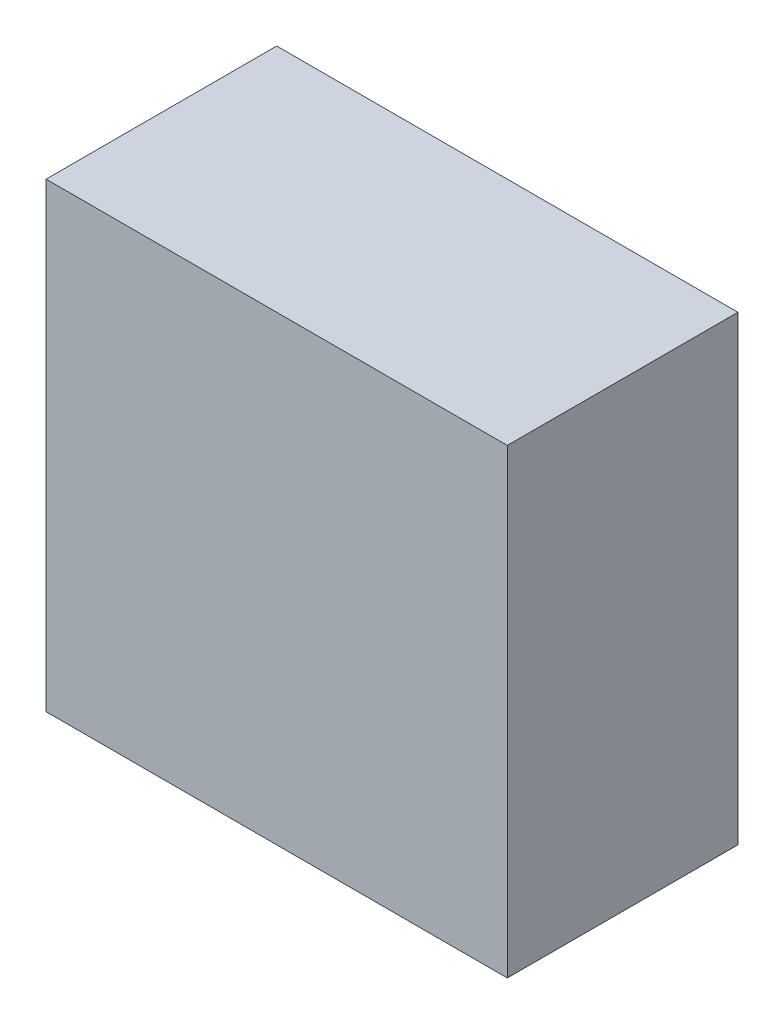
ISO-10303-21;
HEADER;
FILE_DESCRIPTION(('STEP AP214'),'2;1');
FILE_NAME('part.step','',(''),(''),'','','');
FILE_SCHEMA(('AUTOMOTIVE_DESIGN { 1 0 10303 214 1 1 1 1 }'));
ENDSEC;
DATA;
#1=APPLICATION_CONTEXT('core data for automotive mechanical design processes');
#2=APPLICATION_PROTOCOL_DEFINITION('international standard','automotive_design',2000,#1);
#3=PRODUCT_CONTEXT('',#1,'mechanical');
#4=PRODUCT('Part','Part','',(#3));
#5=PRODUCT_RELATED_PRODUCT_CATEGORY('part','',(#4));
#6=PRODUCT_DEFINITION_FORMATION('','',#4);
#7=PRODUCT_DEFINITION_CONTEXT('part definition',#1,'design');
#8=PRODUCT_DEFINITION('design','',#6,#7);
#9=PRODUCT_DEFINITION_SHAPE('','',#8);
#10=(LENGTH_UNIT() NAMED_UNIT(*) SI_UNIT(.MILLI.,.METRE.));
#11=(NAMED_UNIT(*) PLANE_ANGLE_UNIT() SI_UNIT($,.RADIAN.));
#12=(NAMED_UNIT(*) SI_UNIT($,.STERADIAN.) SOLID_ANGLE_UNIT());
#13=UNCERTAINTY_MEASURE_WITH_UNIT(LENGTH_MEASURE(1.E-05),#10,'distance_accuracy_value','');
#14=(GEOMETRIC_REPRESENTATION_CONTEXT(3) GLOBAL_UNCERTAINTY_ASSIGNED_CONTEXT((#13)) GLOBAL_UNIT_ASSIGNED_CONTEXT((#10,
#11,#12)) REPRESENTATION_CONTEXT('',''));
#15=CARTESIAN_POINT('',(0.,0.,0.));
#16=DIRECTION('',(0.,0.,1.));
#17=DIRECTION('',(1.,0.,0.));
#18=AXIS2_PLACEMENT_3D('',#15,#16,#17);
#19=CARTESIAN_POINT('',(0.,0.,2.75));
#20=DIRECTION('',(0.,0.,-1.));
#21=DIRECTION('',(-1.,0.,0.));
#22=AXIS2_PLACEMENT_3D('',#19,#20,#21);
#23=PLANE('',#22);
#24=DIRECTION('',(1.,0.,0.));
#25=VECTOR('',#24,1.);
#26=CARTESIAN_POINT('',(22.,165.941489418563,2.75));
#27=LINE('',#26,#25);
#28=CARTESIAN_POINT('',(18.,165.941489418563,2.75));
#29=VERTEX_POINT('',#28);
#30=CARTESIAN_POINT('',(22.,165.941489418563,2.75));
#31=VERTEX_POINT('',#30);
#32=EDGE_CURVE('E80',#29,#31,#27,.T.);
#33=ORIENTED_EDGE('',*,*,#32,.T.);
#34=DIRECTION('',(0.,1.,0.));
#35=VECTOR('',#34,1.);
#36=CARTESIAN_POINT('',(22.,169.941489418563,2.75));
#37=LINE('',#36,#35);
#38=CARTESIAN_POINT('',(22.,169.941489418563,2.75));
#39=VERTEX_POINT('',#38);
#40=EDGE_CURVE('E55',#31,#39,#37,.T.);
#41=ORIENTED_EDGE('',*,*,#40,.T.);
#42=DIRECTION('',(1.,0.,0.));
#43=VECTOR('',#42,1.);
#44=CARTESIAN_POINT('',(22.,169.941489418563,2.75));
#45=LINE('',#44,#43);
#46=CARTESIAN_POINT('',(18.,169.941489418563,2.75));
#47=VERTEX_POINT('',#46);
#48=EDGE_CURVE('E57',#39,#47,#45,.F.);
#49=ORIENTED_EDGE('',*,*,#48,.T.);
#50=DIRECTION('',(0.,1.,0.));
#51=VECTOR('',#50,1.);
#52=CARTESIAN_POINT('',(18.,169.941489418563,2.75));
#53=LINE('',#52,#51);
#54=EDGE_CURVE('E20',#47,#29,#53,.F.);
#55=ORIENTED_EDGE('',*,*,#54,.T.);
#56=EDGE_LOOP('',(#33,#41,#49,#55));
#57=FACE_BOUND('',#56,.T.);
#58=ADVANCED_FACE('F17',(#57),#23,.F.);
#59=CARTESIAN_POINT('',(18.,169.941489418563,2.75));
#60=DIRECTION('',(1.,0.,0.));
#61=DIRECTION('',(0.,0.,-1.));
#62=AXIS2_PLACEMENT_3D('',#59,#60,#61);
#63=PLANE('',#62);
#64=DIRECTION('',(0.,0.,1.));
#65=VECTOR('',#64,1.);
#66=CARTESIAN_POINT('',(18.,165.941489418563,2.75));
#67=LINE('',#66,#65);
#68=CARTESIAN_POINT('',(18.,165.941489418563,0.75));
#69=VERTEX_POINT('',#68);
#70=EDGE_CURVE('E68',#69,#29,#67,.T.);
#71=ORIENTED_EDGE('',*,*,#70,.T.);
#72=ORIENTED_EDGE('',*,*,#54,.F.);
#73=DIRECTION('',(0.,0.,-1.));
#74=VECTOR('',#73,1.);
#75=CARTESIAN_POINT('',(18.,169.941489418563,2.75));
#76=LINE('',#75,#74);
#77=CARTESIAN_POINT('',(18.,169.941489418563,0.75));
#78=VERTEX_POINT('',#77);
#79=EDGE_CURVE('E63',#47,#78,#76,.T.);
#80=ORIENTED_EDGE('',*,*,#79,.T.);
#81=DIRECTION('',(0.,1.,0.));
#82=VECTOR('',#81,1.);
#83=CARTESIAN_POINT('',(18.,0.,0.75));
#84=LINE('',#83,#82);
#85=EDGE_CURVE('E83',#69,#78,#84,.T.);
#86=ORIENTED_EDGE('',*,*,#85,.F.);
#87=EDGE_LOOP('',(#71,#72,#80,#86));
#88=FACE_BOUND('',#87,.T.);
#89=ADVANCED_FACE('F65',(#88),#63,.F.);
#90=CARTESIAN_POINT('',(22.,169.941489418563,2.75));
#91=DIRECTION('',(0.,-1.,0.));
#92=DIRECTION('',(0.,0.,-1.));
#93=AXIS2_PLACEMENT_3D('',#90,#91,#92);
#94=PLANE('',#93);
#95=ORIENTED_EDGE('',*,*,#79,.F.);
#96=ORIENTED_EDGE('',*,*,#48,.F.);
#97=DIRECTION('',(0.,0.,1.));
#98=VECTOR('',#97,1.);
#99=CARTESIAN_POINT('',(22.,169.941489418563,2.75));
#100=LINE('',#99,#98);
#101=CARTESIAN_POINT('',(22.,169.941489418563,0.75));
#102=VERTEX_POINT('',#101);
#103=EDGE_CURVE('E75',#39,#102,#100,.F.);
#104=ORIENTED_EDGE('',*,*,#103,.T.);
#105=DIRECTION('',(-1.,0.,0.));
#106=VECTOR('',#105,1.);
#107=CARTESIAN_POINT('',(0.,169.941489418563,0.75));
#108=LINE('',#107,#106);
#109=EDGE_CURVE('E72',#78,#102,#108,.F.);
#110=ORIENTED_EDGE('',*,*,#109,.F.);
#111=EDGE_LOOP('',(#95,#96,#104,#110));
#112=FACE_BOUND('',#111,.T.);
#113=ADVANCED_FACE('F70',(#112),#94,.F.);
#114=CARTESIAN_POINT('',(22.,169.941489418563,2.75));
#115=DIRECTION('',(-1.,0.,0.));
#116=DIRECTION('',(0.,0.,1.));
#117=AXIS2_PLACEMENT_3D('',#114,#115,#116);
#118=PLANE('',#117);
#119=ORIENTED_EDGE('',*,*,#103,.F.);
#120=ORIENTED_EDGE('',*,*,#40,.F.);
#121=DIRECTION('',(0.,0.,1.));
#122=VECTOR('',#121,1.);
#123=CARTESIAN_POINT('',(22.,165.941489418563,2.75));
#124=LINE('',#123,#122);
#125=CARTESIAN_POINT('',(22.,165.941489418563,0.75));
#126=VERTEX_POINT('',#125);
#127=EDGE_CURVE('E35',#31,#126,#124,.F.);
#128=ORIENTED_EDGE('',*,*,#127,.T.);
#129=DIRECTION('',(0.,1.,0.));
#130=VECTOR('',#129,1.);
#131=CARTESIAN_POINT('',(22.,0.,0.75));
#132=LINE('',#131,#130);
#133=EDGE_CURVE('E26',#102,#126,#132,.F.);
#134=ORIENTED_EDGE('',*,*,#133,.F.);
#135=EDGE_LOOP('',(#119,#120,#128,#134));
#136=FACE_BOUND('',#135,.T.);
#137=ADVANCED_FACE('F89',(#136),#118,.F.);
#138=CARTESIAN_POINT('',(22.,165.941489418563,2.75));
#139=DIRECTION('',(0.,1.,0.));
#140=DIRECTION('',(0.,0.,1.));
#141=AXIS2_PLACEMENT_3D('',#138,#139,#140);
#142=PLANE('',#141);
#143=ORIENTED_EDGE('',*,*,#127,.F.);
#144=ORIENTED_EDGE('',*,*,#32,.F.);
#145=ORIENTED_EDGE('',*,*,#70,.F.);
#146=DIRECTION('',(-1.,0.,0.));
#147=VECTOR('',#146,1.);
#148=CARTESIAN_POINT('',(0.,165.941489418563,0.75));
#149=LINE('',#148,#147);
#150=EDGE_CURVE('E11',#126,#69,#149,.T.);
#151=ORIENTED_EDGE('',*,*,#150,.F.);
#152=EDGE_LOOP('',(#143,#144,#145,#151));
#153=FACE_BOUND('',#152,.T.);
#154=ADVANCED_FACE('F91',(#153),#142,.F.);
#155=CARTESIAN_POINT('',(0.,0.,0.75));
#156=DIRECTION('',(0.,0.,-1.));
#157=DIRECTION('',(-1.,0.,0.));
#158=AXIS2_PLACEMENT_3D('',#155,#156,#157);
#159=PLANE('',#158);
#160=ORIENTED_EDGE('',*,*,#133,.T.);
#161=ORIENTED_EDGE('',*,*,#150,.T.);
#162=ORIENTED_EDGE('',*,*,#85,.T.);
#163=ORIENTED_EDGE('',*,*,#109,.T.);
#164=EDGE_LOOP('',(#160,#161,#162,#163));
#165=FACE_BOUND('',#164,.T.);
#166=ADVANCED_FACE('F88',(#165),#159,.T.);
#167=CLOSED_SHELL('',(#58,#89,#113,#137,#154,#166));
#168=MANIFOLD_SOLID_BREP('B1',#167);
#169=ADVANCED_BREP_SHAPE_REPRESENTATION('',(#18,#168),#14);
#170=SHAPE_DEFINITION_REPRESENTATION(#9,#169);
ENDSEC;
END-ISO-10303-21;
